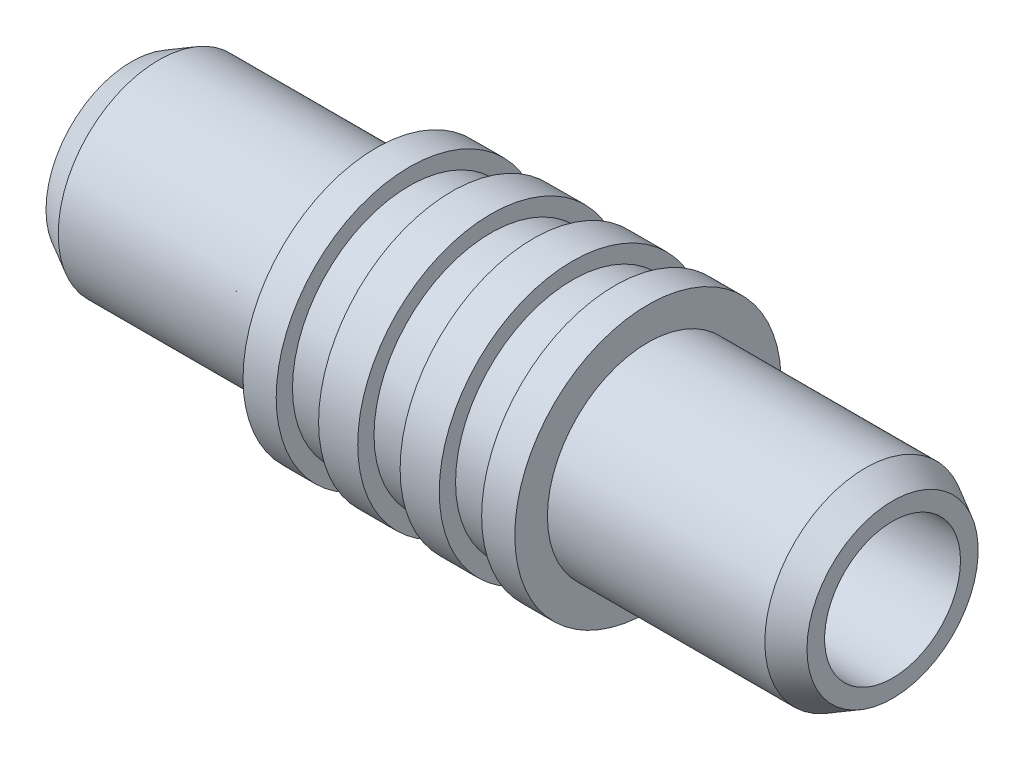
ISO-10303-21;
HEADER;
FILE_DESCRIPTION(('STEP AP214'),'2;1');
FILE_NAME('part.step','',(''),(''),'','','');
FILE_SCHEMA(('AUTOMOTIVE_DESIGN { 1 0 10303 214 1 1 1 1 }'));
ENDSEC;
DATA;
#1=APPLICATION_CONTEXT('core data for automotive mechanical design processes');
#2=APPLICATION_PROTOCOL_DEFINITION('international standard','automotive_design',2000,#1);
#3=PRODUCT_CONTEXT('',#1,'mechanical');
#4=PRODUCT('Part','Part','',(#3));
#5=PRODUCT_RELATED_PRODUCT_CATEGORY('part','',(#4));
#6=PRODUCT_DEFINITION_FORMATION('','',#4);
#7=PRODUCT_DEFINITION_CONTEXT('part definition',#1,'design');
#8=PRODUCT_DEFINITION('design','',#6,#7);
#9=PRODUCT_DEFINITION_SHAPE('','',#8);
#10=(LENGTH_UNIT() NAMED_UNIT(*) SI_UNIT(.MILLI.,.METRE.));
#11=(NAMED_UNIT(*) PLANE_ANGLE_UNIT() SI_UNIT($,.RADIAN.));
#12=(NAMED_UNIT(*) SI_UNIT($,.STERADIAN.) SOLID_ANGLE_UNIT());
#13=UNCERTAINTY_MEASURE_WITH_UNIT(LENGTH_MEASURE(1.E-05),#10,'distance_accuracy_value','');
#14=(GEOMETRIC_REPRESENTATION_CONTEXT(3) GLOBAL_UNCERTAINTY_ASSIGNED_CONTEXT((#13)) GLOBAL_UNIT_ASSIGNED_CONTEXT((#10,
#11,#12)) REPRESENTATION_CONTEXT('',''));
#15=CARTESIAN_POINT('',(0.,0.,0.));
#16=DIRECTION('',(0.,0.,1.));
#17=DIRECTION('',(1.,0.,0.));
#18=AXIS2_PLACEMENT_3D('',#15,#16,#17);
#19=CARTESIAN_POINT('',(0.,0.,0.));
#20=DIRECTION('',(-1.,0.,0.));
#21=DIRECTION('',(0.,0.,1.));
#22=AXIS2_PLACEMENT_3D('',#19,#20,#21);
#23=CYLINDRICAL_SURFACE('',#22,2.0193);
#24=CARTESIAN_POINT('',(-17.78,0.,0.));
#25=DIRECTION('',(-1.,0.,0.));
#26=DIRECTION('',(0.,0.,1.));
#27=AXIS2_PLACEMENT_3D('',#24,#25,#26);
#28=CIRCLE('',#27,2.0193);
#29=CARTESIAN_POINT('',(-17.78,0.,2.0193));
#30=VERTEX_POINT('',#29);
#31=EDGE_CURVE('E105',#30,#30,#28,.T.);
#32=ORIENTED_EDGE('',*,*,#31,.T.);
#33=EDGE_LOOP('',(#32));
#34=FACE_BOUND('',#33,.T.);
#35=CARTESIAN_POINT('',(11.4808,0.,0.));
#36=DIRECTION('',(1.,0.,0.));
#37=DIRECTION('',(0.,0.,-1.));
#38=AXIS2_PLACEMENT_3D('',#35,#36,#37);
#39=CIRCLE('',#38,2.0193);
#40=CARTESIAN_POINT('',(11.4808,0.,-2.0193));
#41=VERTEX_POINT('',#40);
#42=EDGE_CURVE('E39',#41,#41,#39,.F.);
#43=ORIENTED_EDGE('',*,*,#42,.F.);
#44=EDGE_LOOP('',(#43));
#45=FACE_BOUND('',#44,.T.);
#46=ADVANCED_FACE('F36',(#34,#45),#23,.F.);
#47=CARTESIAN_POINT('',(0.,0.,0.));
#48=DIRECTION('',(-1.,0.,0.));
#49=DIRECTION('',(0.,0.,1.));
#50=AXIS2_PLACEMENT_3D('',#47,#48,#49);
#51=CYLINDRICAL_SURFACE('',#50,6.223);
#52=CARTESIAN_POINT('',(6.35,0.,0.));
#53=DIRECTION('',(-1.,0.,0.));
#54=DIRECTION('',(0.,0.,1.));
#55=AXIS2_PLACEMENT_3D('',#52,#53,#54);
#56=CIRCLE('',#55,6.223);
#57=CARTESIAN_POINT('',(6.35,0.,6.223));
#58=VERTEX_POINT('',#57);
#59=EDGE_CURVE('E108',#58,#58,#56,.T.);
#60=ORIENTED_EDGE('',*,*,#59,.T.);
#61=EDGE_LOOP('',(#60));
#62=FACE_BOUND('',#61,.T.);
#63=CARTESIAN_POINT('',(4.8006,0.,0.));
#64=DIRECTION('',(-1.,0.,0.));
#65=DIRECTION('',(0.,0.,1.));
#66=AXIS2_PLACEMENT_3D('',#63,#64,#65);
#67=CIRCLE('',#66,6.223);
#68=CARTESIAN_POINT('',(4.8006,0.,6.223));
#69=VERTEX_POINT('',#68);
#70=EDGE_CURVE('E72',#69,#69,#67,.T.);
#71=ORIENTED_EDGE('',*,*,#70,.F.);
#72=EDGE_LOOP('',(#71));
#73=FACE_BOUND('',#72,.T.);
#74=ADVANCED_FACE('F131',(#62,#73),#51,.T.);
#75=CARTESIAN_POINT('',(0.9906,0.,0.));
#76=DIRECTION('',(-1.,0.,0.));
#77=DIRECTION('',(0.,0.,1.));
#78=AXIS2_PLACEMENT_3D('',#75,#76,#77);
#79=CIRCLE('',#78,6.223);
#80=CARTESIAN_POINT('',(0.9906,0.,6.223));
#81=VERTEX_POINT('',#80);
#82=EDGE_CURVE('E55',#81,#81,#79,.T.);
#83=ORIENTED_EDGE('',*,*,#82,.F.);
#84=EDGE_LOOP('',(#83));
#85=FACE_BOUND('',#84,.T.);
#86=CARTESIAN_POINT('',(2.8194,0.,0.));
#87=DIRECTION('',(1.,0.,0.));
#88=DIRECTION('',(0.,0.,-1.));
#89=AXIS2_PLACEMENT_3D('',#86,#87,#88);
#90=CIRCLE('',#89,6.223);
#91=CARTESIAN_POINT('',(2.8194,0.,-6.223));
#92=VERTEX_POINT('',#91);
#93=EDGE_CURVE('E70',#92,#92,#90,.T.);
#94=ORIENTED_EDGE('',*,*,#93,.F.);
#95=EDGE_LOOP('',(#94));
#96=FACE_BOUND('',#95,.T.);
#97=ADVANCED_FACE('F136',(#85,#96),#51,.T.);
#98=CARTESIAN_POINT('',(-0.9906,0.,0.));
#99=DIRECTION('',(1.,0.,0.));
#100=DIRECTION('',(0.,0.,-1.));
#101=AXIS2_PLACEMENT_3D('',#98,#99,#100);
#102=CIRCLE('',#101,6.223);
#103=CARTESIAN_POINT('',(-0.9906,0.,-6.223));
#104=VERTEX_POINT('',#103);
#105=EDGE_CURVE('E52',#104,#104,#102,.T.);
#106=ORIENTED_EDGE('',*,*,#105,.F.);
#107=EDGE_LOOP('',(#106));
#108=FACE_BOUND('',#107,.T.);
#109=CARTESIAN_POINT('',(-2.8194,0.,0.));
#110=DIRECTION('',(-1.,0.,0.));
#111=DIRECTION('',(0.,0.,1.));
#112=AXIS2_PLACEMENT_3D('',#109,#110,#111);
#113=CIRCLE('',#112,6.223);
#114=CARTESIAN_POINT('',(-2.8194,0.,6.223));
#115=VERTEX_POINT('',#114);
#116=EDGE_CURVE('E64',#115,#115,#113,.T.);
#117=ORIENTED_EDGE('',*,*,#116,.F.);
#118=EDGE_LOOP('',(#117));
#119=FACE_BOUND('',#118,.T.);
#120=ADVANCED_FACE('F338',(#108,#119),#51,.T.);
#121=CARTESIAN_POINT('',(-6.35,0.,0.));
#122=DIRECTION('',(-1.,0.,0.));
#123=DIRECTION('',(0.,0.,1.));
#124=AXIS2_PLACEMENT_3D('',#121,#122,#123);
#125=CIRCLE('',#124,6.223);
#126=CARTESIAN_POINT('',(-6.35,0.,6.223));
#127=VERTEX_POINT('',#126);
#128=EDGE_CURVE('E59',#127,#127,#125,.T.);
#129=ORIENTED_EDGE('',*,*,#128,.F.);
#130=EDGE_LOOP('',(#129));
#131=FACE_BOUND('',#130,.T.);
#132=CARTESIAN_POINT('',(-4.8006,0.,0.));
#133=DIRECTION('',(1.,0.,0.));
#134=DIRECTION('',(0.,0.,-1.));
#135=AXIS2_PLACEMENT_3D('',#132,#133,#134);
#136=CIRCLE('',#135,6.223);
#137=CARTESIAN_POINT('',(-4.8006,0.,-6.223));
#138=VERTEX_POINT('',#137);
#139=EDGE_CURVE('E60',#138,#138,#136,.T.);
#140=ORIENTED_EDGE('',*,*,#139,.F.);
#141=EDGE_LOOP('',(#140));
#142=FACE_BOUND('',#141,.T.);
#143=ADVANCED_FACE('F128',(#131,#142),#51,.T.);
#144=CARTESIAN_POINT('',(17.78,2.0193,0.));
#145=DIRECTION('',(-1.,0.,0.));
#146=DIRECTION('',(0.,0.,1.));
#147=AXIS2_PLACEMENT_3D('',#144,#145,#146);
#148=PLANE('',#147);
#149=CARTESIAN_POINT('',(17.78,0.,0.));
#150=DIRECTION('',(1.,0.,0.));
#151=DIRECTION('',(0.,0.,-1.));
#152=AXIS2_PLACEMENT_3D('',#149,#150,#151);
#153=CIRCLE('',#152,3.175);
#154=CARTESIAN_POINT('',(17.78,0.,-3.175));
#155=VERTEX_POINT('',#154);
#156=EDGE_CURVE('E148',#155,#155,#153,.T.);
#157=ORIENTED_EDGE('',*,*,#156,.F.);
#158=EDGE_LOOP('',(#157));
#159=FACE_BOUND('',#158,.T.);
#160=CARTESIAN_POINT('',(17.78,0.,0.));
#161=DIRECTION('',(-1.,0.,0.));
#162=DIRECTION('',(0.,0.,1.));
#163=AXIS2_PLACEMENT_3D('',#160,#161,#162);
#164=CIRCLE('',#163,4.0005);
#165=CARTESIAN_POINT('',(17.78,0.,4.0005));
#166=VERTEX_POINT('',#165);
#167=EDGE_CURVE('E10',#166,#166,#164,.T.);
#168=ORIENTED_EDGE('',*,*,#167,.F.);
#169=EDGE_LOOP('',(#168));
#170=FACE_BOUND('',#169,.T.);
#171=ADVANCED_FACE('F123',(#159,#170),#148,.F.);
#172=CARTESIAN_POINT('',(17.78,0.,0.));
#173=DIRECTION('',(-1.,0.,0.));
#174=DIRECTION('',(0.,0.,1.));
#175=AXIS2_PLACEMENT_3D('',#172,#173,#174);
#176=CONICAL_SURFACE('',#175,4.0005,0.502843210927861);
#177=CARTESIAN_POINT('',(16.51,0.,0.));
#178=DIRECTION('',(-1.,0.,0.));
#179=DIRECTION('',(0.,0.,1.));
#180=AXIS2_PLACEMENT_3D('',#177,#178,#179);
#181=CIRCLE('',#180,4.699);
#182=CARTESIAN_POINT('',(16.51,0.,4.699));
#183=VERTEX_POINT('',#182);
#184=EDGE_CURVE('E43',#183,#183,#181,.T.);
#185=ORIENTED_EDGE('',*,*,#184,.F.);
#186=EDGE_LOOP('',(#185));
#187=FACE_BOUND('',#186,.T.);
#188=ORIENTED_EDGE('',*,*,#167,.T.);
#189=EDGE_LOOP('',(#188));
#190=FACE_BOUND('',#189,.T.);
#191=ADVANCED_FACE('F118',(#187,#190),#176,.T.);
#192=CARTESIAN_POINT('',(0.,0.,0.));
#193=DIRECTION('',(-1.,0.,0.));
#194=DIRECTION('',(0.,0.,1.));
#195=AXIS2_PLACEMENT_3D('',#192,#193,#194);
#196=CYLINDRICAL_SURFACE('',#195,4.699);
#197=CARTESIAN_POINT('',(6.35,0.,0.));
#198=DIRECTION('',(-1.,0.,0.));
#199=DIRECTION('',(0.,0.,1.));
#200=AXIS2_PLACEMENT_3D('',#197,#198,#199);
#201=CIRCLE('',#200,4.699);
#202=CARTESIAN_POINT('',(6.35,0.,4.699));
#203=VERTEX_POINT('',#202);
#204=EDGE_CURVE('E48',#203,#203,#201,.T.);
#205=ORIENTED_EDGE('',*,*,#204,.F.);
#206=EDGE_LOOP('',(#205));
#207=FACE_BOUND('',#206,.T.);
#208=ORIENTED_EDGE('',*,*,#184,.T.);
#209=EDGE_LOOP('',(#208));
#210=FACE_BOUND('',#209,.T.);
#211=ADVANCED_FACE('F115',(#207,#210),#196,.T.);
#212=CARTESIAN_POINT('',(6.35,6.223,0.));
#213=DIRECTION('',(-1.,0.,0.));
#214=DIRECTION('',(0.,0.,1.));
#215=AXIS2_PLACEMENT_3D('',#212,#213,#214);
#216=PLANE('',#215);
#217=ORIENTED_EDGE('',*,*,#59,.F.);
#218=EDGE_LOOP('',(#217));
#219=FACE_BOUND('',#218,.T.);
#220=ORIENTED_EDGE('',*,*,#204,.T.);
#221=EDGE_LOOP('',(#220));
#222=FACE_BOUND('',#221,.T.);
#223=ADVANCED_FACE('F113',(#219,#222),#216,.F.);
#224=CARTESIAN_POINT('',(-17.78,2.0193,0.));
#225=DIRECTION('',(1.,0.,0.));
#226=DIRECTION('',(0.,0.,1.));
#227=AXIS2_PLACEMENT_3D('',#224,#225,#226);
#228=PLANE('',#227);
#229=CARTESIAN_POINT('',(-17.78,0.,0.));
#230=DIRECTION('',(-1.,0.,0.));
#231=DIRECTION('',(0.,0.,1.));
#232=AXIS2_PLACEMENT_3D('',#229,#230,#231);
#233=CIRCLE('',#232,4.0005);
#234=CARTESIAN_POINT('',(-17.78,0.,4.0005));
#235=VERTEX_POINT('',#234);
#236=EDGE_CURVE('E102',#235,#235,#233,.T.);
#237=ORIENTED_EDGE('',*,*,#236,.T.);
#238=EDGE_LOOP('',(#237));
#239=FACE_BOUND('',#238,.T.);
#240=ORIENTED_EDGE('',*,*,#31,.F.);
#241=EDGE_LOOP('',(#240));
#242=FACE_BOUND('',#241,.T.);
#243=ADVANCED_FACE('F213',(#239,#242),#228,.F.);
#244=CARTESIAN_POINT('',(-17.78,0.,0.));
#245=DIRECTION('',(1.,0.,0.));
#246=DIRECTION('',(0.,0.,1.));
#247=AXIS2_PLACEMENT_3D('',#244,#245,#246);
#248=CONICAL_SURFACE('',#247,4.0005,0.502843210927861);
#249=CARTESIAN_POINT('',(-16.51,0.,0.));
#250=DIRECTION('',(-1.,0.,0.));
#251=DIRECTION('',(0.,0.,1.));
#252=AXIS2_PLACEMENT_3D('',#249,#250,#251);
#253=CIRCLE('',#252,4.699);
#254=CARTESIAN_POINT('',(-16.51,0.,4.699));
#255=VERTEX_POINT('',#254);
#256=EDGE_CURVE('E99',#255,#255,#253,.T.);
#257=ORIENTED_EDGE('',*,*,#256,.T.);
#258=EDGE_LOOP('',(#257));
#259=FACE_BOUND('',#258,.T.);
#260=ORIENTED_EDGE('',*,*,#236,.F.);
#261=EDGE_LOOP('',(#260));
#262=FACE_BOUND('',#261,.T.);
#263=ADVANCED_FACE('F209',(#259,#262),#248,.T.);
#264=CARTESIAN_POINT('',(0.,0.,0.));
#265=DIRECTION('',(1.,0.,0.));
#266=DIRECTION('',(0.,0.,1.));
#267=AXIS2_PLACEMENT_3D('',#264,#265,#266);
#268=CYLINDRICAL_SURFACE('',#267,4.699);
#269=CARTESIAN_POINT('',(-6.35,0.,0.));
#270=DIRECTION('',(-1.,0.,0.));
#271=DIRECTION('',(0.,0.,1.));
#272=AXIS2_PLACEMENT_3D('',#269,#270,#271);
#273=CIRCLE('',#272,4.699);
#274=CARTESIAN_POINT('',(-6.35,0.,4.699));
#275=VERTEX_POINT('',#274);
#276=EDGE_CURVE('E96',#275,#275,#273,.T.);
#277=ORIENTED_EDGE('',*,*,#276,.T.);
#278=EDGE_LOOP('',(#277));
#279=FACE_BOUND('',#278,.T.);
#280=ORIENTED_EDGE('',*,*,#256,.F.);
#281=EDGE_LOOP('',(#280));
#282=FACE_BOUND('',#281,.T.);
#283=ADVANCED_FACE('F205',(#279,#282),#268,.T.);
#284=CARTESIAN_POINT('',(-6.35,6.223,0.));
#285=DIRECTION('',(1.,0.,0.));
#286=DIRECTION('',(0.,0.,1.));
#287=AXIS2_PLACEMENT_3D('',#284,#285,#286);
#288=PLANE('',#287);
#289=ORIENTED_EDGE('',*,*,#128,.T.);
#290=EDGE_LOOP('',(#289));
#291=FACE_BOUND('',#290,.T.);
#292=ORIENTED_EDGE('',*,*,#276,.F.);
#293=EDGE_LOOP('',(#292));
#294=FACE_BOUND('',#293,.T.);
#295=ADVANCED_FACE('F201',(#291,#294),#288,.F.);
#296=CARTESIAN_POINT('',(0.9906,5.461,0.));
#297=DIRECTION('',(-1.,0.,0.));
#298=DIRECTION('',(0.,0.,1.));
#299=AXIS2_PLACEMENT_3D('',#296,#297,#298);
#300=PLANE('',#299);
#301=CARTESIAN_POINT('',(0.9906,0.,0.));
#302=DIRECTION('',(-1.,0.,0.));
#303=DIRECTION('',(0.,0.,1.));
#304=AXIS2_PLACEMENT_3D('',#301,#302,#303);
#305=CIRCLE('',#304,5.461);
#306=CARTESIAN_POINT('',(0.9906,0.,5.461));
#307=VERTEX_POINT('',#306);
#308=EDGE_CURVE('E56',#307,#307,#305,.T.);
#309=ORIENTED_EDGE('',*,*,#308,.F.);
#310=EDGE_LOOP('',(#309));
#311=FACE_BOUND('',#310,.T.);
#312=ORIENTED_EDGE('',*,*,#82,.T.);
#313=EDGE_LOOP('',(#312));
#314=FACE_BOUND('',#313,.T.);
#315=ADVANCED_FACE('F194',(#311,#314),#300,.T.);
#316=CARTESIAN_POINT('',(-0.9906,5.461,0.));
#317=DIRECTION('',(1.,0.,0.));
#318=DIRECTION('',(0.,0.,-1.));
#319=AXIS2_PLACEMENT_3D('',#316,#317,#318);
#320=PLANE('',#319);
#321=CARTESIAN_POINT('',(-0.9906,0.,0.));
#322=DIRECTION('',(-1.,0.,0.));
#323=DIRECTION('',(0.,0.,1.));
#324=AXIS2_PLACEMENT_3D('',#321,#322,#323);
#325=CIRCLE('',#324,5.461);
#326=CARTESIAN_POINT('',(-0.9906,0.,5.461));
#327=VERTEX_POINT('',#326);
#328=EDGE_CURVE('E69',#327,#327,#325,.T.);
#329=ORIENTED_EDGE('',*,*,#328,.T.);
#330=EDGE_LOOP('',(#329));
#331=FACE_BOUND('',#330,.T.);
#332=ORIENTED_EDGE('',*,*,#105,.T.);
#333=EDGE_LOOP('',(#332));
#334=FACE_BOUND('',#333,.T.);
#335=ADVANCED_FACE('F191',(#331,#334),#320,.T.);
#336=CARTESIAN_POINT('',(0.,0.,0.));
#337=DIRECTION('',(-1.,0.,0.));
#338=DIRECTION('',(0.,0.,1.));
#339=AXIS2_PLACEMENT_3D('',#336,#337,#338);
#340=CYLINDRICAL_SURFACE('',#339,5.461);
#341=ORIENTED_EDGE('',*,*,#308,.T.);
#342=EDGE_LOOP('',(#341));
#343=FACE_BOUND('',#342,.T.);
#344=ORIENTED_EDGE('',*,*,#328,.F.);
#345=EDGE_LOOP('',(#344));
#346=FACE_BOUND('',#345,.T.);
#347=ADVANCED_FACE('F189',(#343,#346),#340,.T.);
#348=CARTESIAN_POINT('',(-2.8194,5.461,0.));
#349=DIRECTION('',(-1.,0.,0.));
#350=DIRECTION('',(0.,0.,1.));
#351=AXIS2_PLACEMENT_3D('',#348,#349,#350);
#352=PLANE('',#351);
#353=CARTESIAN_POINT('',(-2.8194,0.,0.));
#354=DIRECTION('',(-1.,0.,0.));
#355=DIRECTION('',(0.,0.,1.));
#356=AXIS2_PLACEMENT_3D('',#353,#354,#355);
#357=CIRCLE('',#356,5.461);
#358=CARTESIAN_POINT('',(-2.8194,0.,5.461));
#359=VERTEX_POINT('',#358);
#360=EDGE_CURVE('E65',#359,#359,#357,.T.);
#361=ORIENTED_EDGE('',*,*,#360,.F.);
#362=EDGE_LOOP('',(#361));
#363=FACE_BOUND('',#362,.T.);
#364=ORIENTED_EDGE('',*,*,#116,.T.);
#365=EDGE_LOOP('',(#364));
#366=FACE_BOUND('',#365,.T.);
#367=ADVANCED_FACE('F183',(#363,#366),#352,.T.);
#368=CARTESIAN_POINT('',(-4.8006,5.461,0.));
#369=DIRECTION('',(1.,0.,0.));
#370=DIRECTION('',(0.,0.,-1.));
#371=AXIS2_PLACEMENT_3D('',#368,#369,#370);
#372=PLANE('',#371);
#373=CARTESIAN_POINT('',(-4.8006,0.,0.));
#374=DIRECTION('',(-1.,0.,0.));
#375=DIRECTION('',(0.,0.,1.));
#376=AXIS2_PLACEMENT_3D('',#373,#374,#375);
#377=CIRCLE('',#376,5.461);
#378=CARTESIAN_POINT('',(-4.8006,0.,5.461));
#379=VERTEX_POINT('',#378);
#380=EDGE_CURVE('E75',#379,#379,#377,.T.);
#381=ORIENTED_EDGE('',*,*,#380,.T.);
#382=EDGE_LOOP('',(#381));
#383=FACE_BOUND('',#382,.T.);
#384=ORIENTED_EDGE('',*,*,#139,.T.);
#385=EDGE_LOOP('',(#384));
#386=FACE_BOUND('',#385,.T.);
#387=ADVANCED_FACE('F180',(#383,#386),#372,.T.);
#388=CARTESIAN_POINT('',(0.,0.,0.));
#389=DIRECTION('',(-1.,0.,0.));
#390=DIRECTION('',(0.,0.,1.));
#391=AXIS2_PLACEMENT_3D('',#388,#389,#390);
#392=CYLINDRICAL_SURFACE('',#391,5.461);
#393=ORIENTED_EDGE('',*,*,#360,.T.);
#394=EDGE_LOOP('',(#393));
#395=FACE_BOUND('',#394,.T.);
#396=ORIENTED_EDGE('',*,*,#380,.F.);
#397=EDGE_LOOP('',(#396));
#398=FACE_BOUND('',#397,.T.);
#399=ADVANCED_FACE('F178',(#395,#398),#392,.T.);
#400=CARTESIAN_POINT('',(4.8006,5.461,0.));
#401=DIRECTION('',(-1.,0.,0.));
#402=DIRECTION('',(0.,0.,1.));
#403=AXIS2_PLACEMENT_3D('',#400,#401,#402);
#404=PLANE('',#403);
#405=CARTESIAN_POINT('',(4.8006,0.,0.));
#406=DIRECTION('',(-1.,0.,0.));
#407=DIRECTION('',(0.,0.,1.));
#408=AXIS2_PLACEMENT_3D('',#405,#406,#407);
#409=CIRCLE('',#408,5.461);
#410=CARTESIAN_POINT('',(4.8006,0.,5.461));
#411=VERTEX_POINT('',#410);
#412=EDGE_CURVE('E73',#411,#411,#409,.T.);
#413=ORIENTED_EDGE('',*,*,#412,.F.);
#414=EDGE_LOOP('',(#413));
#415=FACE_BOUND('',#414,.T.);
#416=ORIENTED_EDGE('',*,*,#70,.T.);
#417=EDGE_LOOP('',(#416));
#418=FACE_BOUND('',#417,.T.);
#419=ADVANCED_FACE('F171',(#415,#418),#404,.T.);
#420=CARTESIAN_POINT('',(2.8194,5.461,0.));
#421=DIRECTION('',(1.,0.,0.));
#422=DIRECTION('',(0.,0.,-1.));
#423=AXIS2_PLACEMENT_3D('',#420,#421,#422);
#424=PLANE('',#423);
#425=CARTESIAN_POINT('',(2.8194,0.,0.));
#426=DIRECTION('',(-1.,0.,0.));
#427=DIRECTION('',(0.,0.,1.));
#428=AXIS2_PLACEMENT_3D('',#425,#426,#427);
#429=CIRCLE('',#428,5.461);
#430=CARTESIAN_POINT('',(2.8194,0.,5.461));
#431=VERTEX_POINT('',#430);
#432=EDGE_CURVE('E144',#431,#431,#429,.T.);
#433=ORIENTED_EDGE('',*,*,#432,.T.);
#434=EDGE_LOOP('',(#433));
#435=FACE_BOUND('',#434,.T.);
#436=ORIENTED_EDGE('',*,*,#93,.T.);
#437=EDGE_LOOP('',(#436));
#438=FACE_BOUND('',#437,.T.);
#439=ADVANCED_FACE('F168',(#435,#438),#424,.T.);
#440=CARTESIAN_POINT('',(0.,0.,0.));
#441=DIRECTION('',(-1.,0.,0.));
#442=DIRECTION('',(0.,0.,1.));
#443=AXIS2_PLACEMENT_3D('',#440,#441,#442);
#444=CYLINDRICAL_SURFACE('',#443,5.461);
#445=ORIENTED_EDGE('',*,*,#412,.T.);
#446=EDGE_LOOP('',(#445));
#447=FACE_BOUND('',#446,.T.);
#448=ORIENTED_EDGE('',*,*,#432,.F.);
#449=EDGE_LOOP('',(#448));
#450=FACE_BOUND('',#449,.T.);
#451=ADVANCED_FACE('F165',(#447,#450),#444,.T.);
#452=CARTESIAN_POINT('',(11.4808,0.,0.));
#453=DIRECTION('',(1.,0.,0.));
#454=DIRECTION('',(0.,0.,-1.));
#455=AXIS2_PLACEMENT_3D('',#452,#453,#454);
#456=PLANE('',#455);
#457=CARTESIAN_POINT('',(11.4808,0.,0.));
#458=DIRECTION('',(1.,0.,0.));
#459=DIRECTION('',(0.,0.,-1.));
#460=AXIS2_PLACEMENT_3D('',#457,#458,#459);
#461=CIRCLE('',#460,3.175);
#462=CARTESIAN_POINT('',(11.4808,0.,-3.175));
#463=VERTEX_POINT('',#462);
#464=EDGE_CURVE('E145',#463,#463,#461,.T.);
#465=ORIENTED_EDGE('',*,*,#464,.T.);
#466=EDGE_LOOP('',(#465));
#467=FACE_BOUND('',#466,.T.);
#468=ORIENTED_EDGE('',*,*,#42,.T.);
#469=EDGE_LOOP('',(#468));
#470=FACE_BOUND('',#469,.T.);
#471=ADVANCED_FACE('F159',(#467,#470),#456,.T.);
#472=CARTESIAN_POINT('',(11.4808,0.,0.));
#473=DIRECTION('',(1.,0.,0.));
#474=DIRECTION('',(0.,0.,-1.));
#475=AXIS2_PLACEMENT_3D('',#472,#473,#474);
#476=CYLINDRICAL_SURFACE('',#475,3.175);
#477=ORIENTED_EDGE('',*,*,#464,.F.);
#478=EDGE_LOOP('',(#477));
#479=FACE_BOUND('',#478,.T.);
#480=ORIENTED_EDGE('',*,*,#156,.T.);
#481=EDGE_LOOP('',(#480));
#482=FACE_BOUND('',#481,.T.);
#483=ADVANCED_FACE('F156',(#479,#482),#476,.F.);
#484=CLOSED_SHELL('',(#46,#74,#97,#120,#143,#171,#191,#211,#223,#243,#263,#283,#295,#315,#335,
#347,#367,#387,#399,#419,#439,#451,#471,#483));
#485=MANIFOLD_SOLID_BREP('B2',#484);
#486=ADVANCED_BREP_SHAPE_REPRESENTATION('',(#18,#485),#14);
#487=SHAPE_DEFINITION_REPRESENTATION(#9,#486);
ENDSEC;
END-ISO-10303-21;
